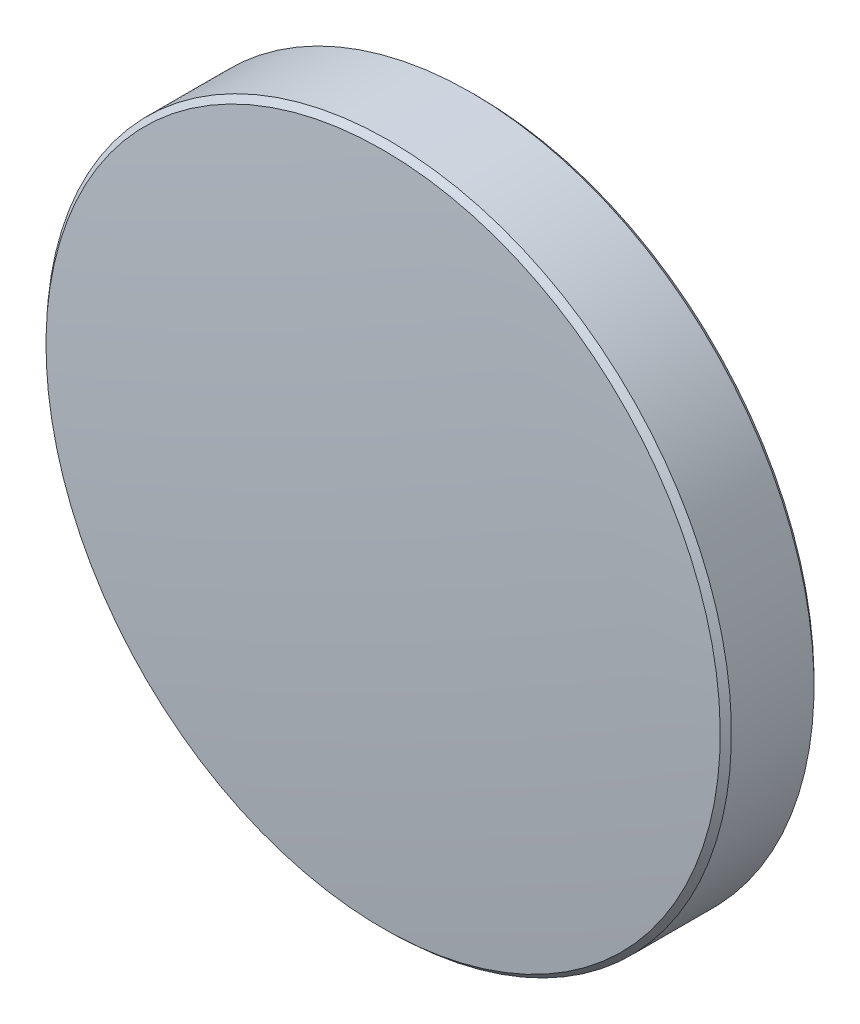
ISO-10303-21;
HEADER;
FILE_DESCRIPTION(('STEP AP214'),'2;1');
FILE_NAME('part.step','',(''),(''),'','','');
FILE_SCHEMA(('AUTOMOTIVE_DESIGN { 1 0 10303 214 1 1 1 1 }'));
ENDSEC;
DATA;
#1=APPLICATION_CONTEXT('core data for automotive mechanical design processes');
#2=APPLICATION_PROTOCOL_DEFINITION('international standard','automotive_design',2000,#1);
#3=PRODUCT_CONTEXT('',#1,'mechanical');
#4=PRODUCT('Part','Part','',(#3));
#5=PRODUCT_RELATED_PRODUCT_CATEGORY('part','',(#4));
#6=PRODUCT_DEFINITION_FORMATION('','',#4);
#7=PRODUCT_DEFINITION_CONTEXT('part definition',#1,'design');
#8=PRODUCT_DEFINITION('design','',#6,#7);
#9=PRODUCT_DEFINITION_SHAPE('','',#8);
#10=(LENGTH_UNIT() NAMED_UNIT(*) SI_UNIT(.MILLI.,.METRE.));
#11=(NAMED_UNIT(*) PLANE_ANGLE_UNIT() SI_UNIT($,.RADIAN.));
#12=(NAMED_UNIT(*) SI_UNIT($,.STERADIAN.) SOLID_ANGLE_UNIT());
#13=UNCERTAINTY_MEASURE_WITH_UNIT(LENGTH_MEASURE(1.E-05),#10,'distance_accuracy_value','');
#14=(GEOMETRIC_REPRESENTATION_CONTEXT(3) GLOBAL_UNCERTAINTY_ASSIGNED_CONTEXT((#13)) GLOBAL_UNIT_ASSIGNED_CONTEXT((#10,
#11,#12)) REPRESENTATION_CONTEXT('',''));
#15=CARTESIAN_POINT('',(0.,0.,0.));
#16=DIRECTION('',(0.,0.,1.));
#17=DIRECTION('',(1.,0.,0.));
#18=AXIS2_PLACEMENT_3D('',#15,#16,#17);
#19=CARTESIAN_POINT('',(0.,0.,-2.));
#20=DIRECTION('',(0.,0.,-1.));
#21=DIRECTION('',(0.,1.,0.));
#22=AXIS2_PLACEMENT_3D('',#19,#20,#21);
#23=PLANE('',#22);
#24=CARTESIAN_POINT('',(0.,0.,-2.));
#25=DIRECTION('',(0.,0.,-1.));
#26=DIRECTION('',(0.,1.,0.));
#27=AXIS2_PLACEMENT_3D('',#24,#25,#26);
#28=CIRCLE('',#27,12.5);
#29=CARTESIAN_POINT('',(0.,12.5,-2.));
#30=VERTEX_POINT('',#29);
#31=EDGE_CURVE('E28',#30,#30,#28,.T.);
#32=ORIENTED_EDGE('',*,*,#31,.T.);
#33=EDGE_LOOP('',(#32));
#34=FACE_BOUND('',#33,.T.);
#35=ADVANCED_FACE('F13',(#34),#23,.T.);
#36=CARTESIAN_POINT('',(0.,0.,-148.34));
#37=DIRECTION('',(0.,0.,-1.));
#38=DIRECTION('',(0.,1.,0.));
#39=AXIS2_PLACEMENT_3D('',#36,#37,#38);
#40=SPHERICAL_SURFACE('',#39,150.34);
#41=CARTESIAN_POINT('',(0.,0.,1.47937259982889));
#42=DIRECTION('',(0.,0.,-1.));
#43=DIRECTION('',(0.,1.,0.));
#44=AXIS2_PLACEMENT_3D('',#41,#42,#43);
#45=CIRCLE('',#44,12.5008477229991);
#46=CARTESIAN_POINT('',(0.,12.5008477229991,1.47937259982889));
#47=VERTEX_POINT('',#46);
#48=EDGE_CURVE('E9',#47,#47,#45,.F.);
#49=ORIENTED_EDGE('',*,*,#48,.T.);
#50=EDGE_LOOP('',(#49));
#51=FACE_BOUND('',#50,.T.);
#52=ADVANCED_FACE('F45',(#51),#40,.T.);
#53=CARTESIAN_POINT('',(0.,0.,-2.));
#54=DIRECTION('',(0.,0.,-1.));
#55=DIRECTION('',(0.,1.,0.));
#56=AXIS2_PLACEMENT_3D('',#53,#54,#55);
#57=CYLINDRICAL_SURFACE('',#56,12.7);
#58=CARTESIAN_POINT('',(0.,0.,-1.8));
#59=DIRECTION('',(0.,0.,-1.));
#60=DIRECTION('',(0.,1.,0.));
#61=AXIS2_PLACEMENT_3D('',#58,#59,#60);
#62=CIRCLE('',#61,12.7);
#63=CARTESIAN_POINT('',(0.,12.7,-1.8));
#64=VERTEX_POINT('',#63);
#65=EDGE_CURVE('E20',#64,#64,#62,.F.);
#66=ORIENTED_EDGE('',*,*,#65,.T.);
#67=EDGE_LOOP('',(#66));
#68=FACE_BOUND('',#67,.T.);
#69=CARTESIAN_POINT('',(0.,0.,1.26262213993456));
#70=DIRECTION('',(0.,0.,1.));
#71=DIRECTION('',(0.,-1.,0.));
#72=AXIS2_PLACEMENT_3D('',#69,#70,#71);
#73=CIRCLE('',#72,12.7);
#74=CARTESIAN_POINT('',(0.,-12.7,1.26262213993455));
#75=VERTEX_POINT('',#74);
#76=EDGE_CURVE('E24',#75,#75,#73,.F.);
#77=ORIENTED_EDGE('',*,*,#76,.T.);
#78=EDGE_LOOP('',(#77));
#79=FACE_BOUND('',#78,.T.);
#80=ADVANCED_FACE('F37',(#68,#79),#57,.T.);
#81=CARTESIAN_POINT('',(0.,0.,-2.));
#82=DIRECTION('',(0.,0.,1.));
#83=DIRECTION('',(0.,-1.,0.));
#84=AXIS2_PLACEMENT_3D('',#81,#82,#83);
#85=CONICAL_SURFACE('',#84,12.5,0.785398163397444);
#86=ORIENTED_EDGE('',*,*,#65,.F.);
#87=EDGE_LOOP('',(#86));
#88=FACE_BOUND('',#87,.T.);
#89=ORIENTED_EDGE('',*,*,#31,.F.);
#90=EDGE_LOOP('',(#89));
#91=FACE_BOUND('',#90,.T.);
#92=ADVANCED_FACE('F35',(#88,#91),#85,.T.);
#93=CARTESIAN_POINT('',(0.,0.,1.26262213993455));
#94=DIRECTION('',(0.,0.,-1.));
#95=DIRECTION('',(0.,1.,0.));
#96=AXIS2_PLACEMENT_3D('',#93,#94,#95);
#97=CONICAL_SURFACE('',#96,12.7,0.743110171622616);
#98=ORIENTED_EDGE('',*,*,#48,.F.);
#99=EDGE_LOOP('',(#98));
#100=FACE_BOUND('',#99,.T.);
#101=ORIENTED_EDGE('',*,*,#76,.F.);
#102=EDGE_LOOP('',(#101));
#103=FACE_BOUND('',#102,.T.);
#104=ADVANCED_FACE('F15',(#100,#103),#97,.T.);
#105=CLOSED_SHELL('',(#35,#52,#80,#92,#104));
#106=MANIFOLD_SOLID_BREP('B1',#105);
#107=ADVANCED_BREP_SHAPE_REPRESENTATION('',(#18,#106),#14);
#108=SHAPE_DEFINITION_REPRESENTATION(#9,#107);
ENDSEC;
END-ISO-10303-21;
